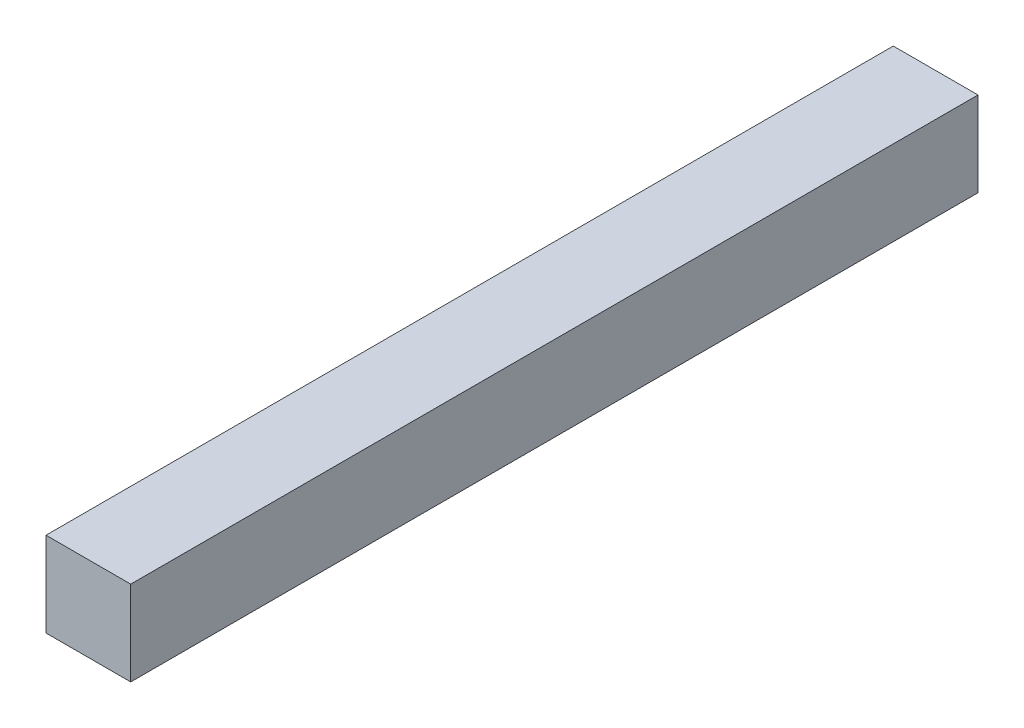
ISO-10303-21;
HEADER;
FILE_DESCRIPTION(('STEP AP214'),'2;1');
FILE_NAME('part.step','',(''),(''),'','','');
FILE_SCHEMA(('AUTOMOTIVE_DESIGN { 1 0 10303 214 1 1 1 1 }'));
ENDSEC;
DATA;
#1=APPLICATION_CONTEXT('core data for automotive mechanical design processes');
#2=APPLICATION_PROTOCOL_DEFINITION('international standard','automotive_design',2000,#1);
#3=PRODUCT_CONTEXT('',#1,'mechanical');
#4=PRODUCT('Part','Part','',(#3));
#5=PRODUCT_RELATED_PRODUCT_CATEGORY('part','',(#4));
#6=PRODUCT_DEFINITION_FORMATION('','',#4);
#7=PRODUCT_DEFINITION_CONTEXT('part definition',#1,'design');
#8=PRODUCT_DEFINITION('design','',#6,#7);
#9=PRODUCT_DEFINITION_SHAPE('','',#8);
#10=(LENGTH_UNIT() NAMED_UNIT(*) SI_UNIT(.MILLI.,.METRE.));
#11=(NAMED_UNIT(*) PLANE_ANGLE_UNIT() SI_UNIT($,.RADIAN.));
#12=(NAMED_UNIT(*) SI_UNIT($,.STERADIAN.) SOLID_ANGLE_UNIT());
#13=UNCERTAINTY_MEASURE_WITH_UNIT(LENGTH_MEASURE(1.E-05),#10,'distance_accuracy_value','');
#14=(GEOMETRIC_REPRESENTATION_CONTEXT(3) GLOBAL_UNCERTAINTY_ASSIGNED_CONTEXT((#13)) GLOBAL_UNIT_ASSIGNED_CONTEXT((#10,
#11,#12)) REPRESENTATION_CONTEXT('',''));
#15=CARTESIAN_POINT('',(0.,0.,0.));
#16=DIRECTION('',(0.,0.,1.));
#17=DIRECTION('',(1.,0.,0.));
#18=AXIS2_PLACEMENT_3D('',#15,#16,#17);
#19=CARTESIAN_POINT('',(0.,0.,205.));
#20=DIRECTION('',(1.,0.,0.));
#21=DIRECTION('',(0.,1.,0.));
#22=AXIS2_PLACEMENT_3D('',#19,#20,#21);
#23=PLANE('',#22);
#24=DIRECTION('',(0.,0.,-1.));
#25=VECTOR('',#24,1.);
#26=CARTESIAN_POINT('',(0.,-10.,205.));
#27=LINE('',#26,#25);
#28=CARTESIAN_POINT('',(0.,-10.,100.));
#29=VERTEX_POINT('',#28);
#30=CARTESIAN_POINT('',(0.,-10.,0.));
#31=VERTEX_POINT('',#30);
#32=EDGE_CURVE('E48',#29,#31,#27,.T.);
#33=ORIENTED_EDGE('',*,*,#32,.F.);
#34=DIRECTION('',(0.,-1.,0.));
#35=VECTOR('',#34,1.);
#36=CARTESIAN_POINT('',(0.,-10.,100.));
#37=LINE('',#36,#35);
#38=CARTESIAN_POINT('',(0.,0.,100.));
#39=VERTEX_POINT('',#38);
#40=EDGE_CURVE('E79',#39,#29,#37,.T.);
#41=ORIENTED_EDGE('',*,*,#40,.F.);
#42=DIRECTION('',(0.,0.,-1.));
#43=VECTOR('',#42,1.);
#44=CARTESIAN_POINT('',(0.,0.,205.));
#45=LINE('',#44,#43);
#46=CARTESIAN_POINT('',(0.,0.,0.));
#47=VERTEX_POINT('',#46);
#48=EDGE_CURVE('E62',#39,#47,#45,.T.);
#49=ORIENTED_EDGE('',*,*,#48,.T.);
#50=DIRECTION('',(0.,-1.,0.));
#51=VECTOR('',#50,1.);
#52=CARTESIAN_POINT('',(0.,0.,0.));
#53=LINE('',#52,#51);
#54=EDGE_CURVE('E93',#47,#31,#53,.T.);
#55=ORIENTED_EDGE('',*,*,#54,.T.);
#56=EDGE_LOOP('',(#33,#41,#49,#55));
#57=FACE_BOUND('',#56,.T.);
#58=ADVANCED_FACE('F41',(#57),#23,.F.);
#59=CARTESIAN_POINT('',(0.,-10.,205.));
#60=DIRECTION('',(0.,1.,0.));
#61=DIRECTION('',(0.,0.,1.));
#62=AXIS2_PLACEMENT_3D('',#59,#60,#61);
#63=PLANE('',#62);
#64=DIRECTION('',(0.,0.,-1.));
#65=VECTOR('',#64,1.);
#66=CARTESIAN_POINT('',(10.,-10.,205.));
#67=LINE('',#66,#65);
#68=CARTESIAN_POINT('',(10.,-10.,100.));
#69=VERTEX_POINT('',#68);
#70=CARTESIAN_POINT('',(10.,-10.,0.));
#71=VERTEX_POINT('',#70);
#72=EDGE_CURVE('E90',#69,#71,#67,.T.);
#73=ORIENTED_EDGE('',*,*,#72,.F.);
#74=DIRECTION('',(1.,0.,0.));
#75=VECTOR('',#74,1.);
#76=CARTESIAN_POINT('',(0.,-10.,100.));
#77=LINE('',#76,#75);
#78=EDGE_CURVE('E82',#29,#69,#77,.T.);
#79=ORIENTED_EDGE('',*,*,#78,.F.);
#80=ORIENTED_EDGE('',*,*,#32,.T.);
#81=DIRECTION('',(1.,0.,0.));
#82=VECTOR('',#81,1.);
#83=CARTESIAN_POINT('',(0.,-10.,0.));
#84=LINE('',#83,#82);
#85=EDGE_CURVE('E104',#31,#71,#84,.T.);
#86=ORIENTED_EDGE('',*,*,#85,.T.);
#87=EDGE_LOOP('',(#73,#79,#80,#86));
#88=FACE_BOUND('',#87,.T.);
#89=ADVANCED_FACE('F87',(#88),#63,.F.);
#90=CARTESIAN_POINT('',(10.,0.,205.));
#91=DIRECTION('',(-1.,0.,0.));
#92=DIRECTION('',(0.,-1.,0.));
#93=AXIS2_PLACEMENT_3D('',#90,#91,#92);
#94=PLANE('',#93);
#95=DIRECTION('',(0.,0.,-1.));
#96=VECTOR('',#95,1.);
#97=CARTESIAN_POINT('',(10.,0.,205.));
#98=LINE('',#97,#96);
#99=CARTESIAN_POINT('',(10.,0.,100.));
#100=VERTEX_POINT('',#99);
#101=CARTESIAN_POINT('',(10.,0.,0.));
#102=VERTEX_POINT('',#101);
#103=EDGE_CURVE('E94',#100,#102,#98,.T.);
#104=ORIENTED_EDGE('',*,*,#103,.F.);
#105=DIRECTION('',(0.,-1.,0.));
#106=VECTOR('',#105,1.);
#107=CARTESIAN_POINT('',(10.,0.,100.));
#108=LINE('',#107,#106);
#109=EDGE_CURVE('E55',#100,#69,#108,.T.);
#110=ORIENTED_EDGE('',*,*,#109,.T.);
#111=ORIENTED_EDGE('',*,*,#72,.T.);
#112=DIRECTION('',(0.,1.,0.));
#113=VECTOR('',#112,1.);
#114=CARTESIAN_POINT('',(10.,0.,0.));
#115=LINE('',#114,#113);
#116=EDGE_CURVE('E101',#71,#102,#115,.T.);
#117=ORIENTED_EDGE('',*,*,#116,.T.);
#118=EDGE_LOOP('',(#104,#110,#111,#117));
#119=FACE_BOUND('',#118,.T.);
#120=ADVANCED_FACE('F109',(#119),#94,.F.);
#121=CARTESIAN_POINT('',(0.,0.,205.));
#122=DIRECTION('',(0.,-1.,0.));
#123=DIRECTION('',(0.,0.,-1.));
#124=AXIS2_PLACEMENT_3D('',#121,#122,#123);
#125=PLANE('',#124);
#126=ORIENTED_EDGE('',*,*,#48,.F.);
#127=DIRECTION('',(1.,0.,0.));
#128=VECTOR('',#127,1.);
#129=CARTESIAN_POINT('',(0.,0.,100.));
#130=LINE('',#129,#128);
#131=EDGE_CURVE('E11',#39,#100,#130,.T.);
#132=ORIENTED_EDGE('',*,*,#131,.T.);
#133=ORIENTED_EDGE('',*,*,#103,.T.);
#134=DIRECTION('',(-1.,0.,0.));
#135=VECTOR('',#134,1.);
#136=CARTESIAN_POINT('',(0.,0.,0.));
#137=LINE('',#136,#135);
#138=EDGE_CURVE('E99',#102,#47,#137,.T.);
#139=ORIENTED_EDGE('',*,*,#138,.T.);
#140=EDGE_LOOP('',(#126,#132,#133,#139));
#141=FACE_BOUND('',#140,.T.);
#142=ADVANCED_FACE('F113',(#141),#125,.F.);
#143=CARTESIAN_POINT('',(0.,0.,0.));
#144=DIRECTION('',(0.,0.,1.));
#145=DIRECTION('',(1.,0.,0.));
#146=AXIS2_PLACEMENT_3D('',#143,#144,#145);
#147=PLANE('',#146);
#148=ORIENTED_EDGE('',*,*,#54,.F.);
#149=ORIENTED_EDGE('',*,*,#138,.F.);
#150=ORIENTED_EDGE('',*,*,#116,.F.);
#151=ORIENTED_EDGE('',*,*,#85,.F.);
#152=EDGE_LOOP('',(#148,#149,#150,#151));
#153=FACE_BOUND('',#152,.T.);
#154=ADVANCED_FACE('F115',(#153),#147,.F.);
#155=CARTESIAN_POINT('',(0.,0.,100.));
#156=DIRECTION('',(0.,0.,-1.));
#157=DIRECTION('',(-1.,0.,0.));
#158=AXIS2_PLACEMENT_3D('',#155,#156,#157);
#159=PLANE('',#158);
#160=ORIENTED_EDGE('',*,*,#131,.F.);
#161=ORIENTED_EDGE('',*,*,#40,.T.);
#162=ORIENTED_EDGE('',*,*,#78,.T.);
#163=ORIENTED_EDGE('',*,*,#109,.F.);
#164=EDGE_LOOP('',(#160,#161,#162,#163));
#165=FACE_BOUND('',#164,.T.);
#166=ADVANCED_FACE('F81',(#165),#159,.F.);
#167=CLOSED_SHELL('',(#58,#89,#120,#142,#154,#166));
#168=MANIFOLD_SOLID_BREP('B2',#167);
#169=ADVANCED_BREP_SHAPE_REPRESENTATION('',(#18,#168),#14);
#170=SHAPE_DEFINITION_REPRESENTATION(#9,#169);
ENDSEC;
END-ISO-10303-21;
